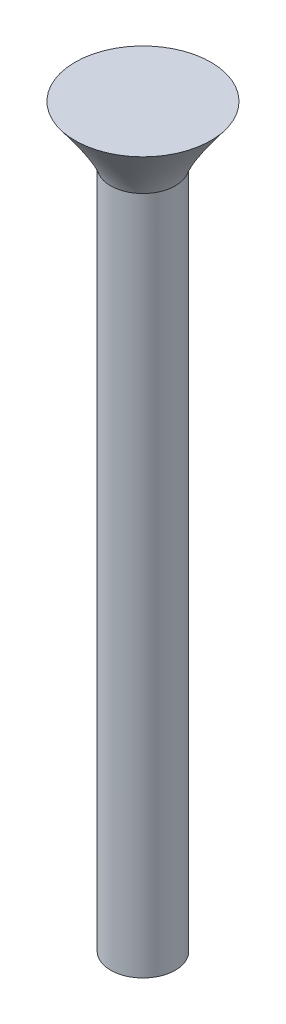
ISO-10303-21;
HEADER;
FILE_DESCRIPTION(('STEP AP214'),'2;1');
FILE_NAME('part.step','',(''),(''),'','','');
FILE_SCHEMA(('AUTOMOTIVE_DESIGN { 1 0 10303 214 1 1 1 1 }'));
ENDSEC;
DATA;
#1=APPLICATION_CONTEXT('core data for automotive mechanical design processes');
#2=APPLICATION_PROTOCOL_DEFINITION('international standard','automotive_design',2000,#1);
#3=PRODUCT_CONTEXT('',#1,'mechanical');
#4=PRODUCT('Part','Part','',(#3));
#5=PRODUCT_RELATED_PRODUCT_CATEGORY('part','',(#4));
#6=PRODUCT_DEFINITION_FORMATION('','',#4);
#7=PRODUCT_DEFINITION_CONTEXT('part definition',#1,'design');
#8=PRODUCT_DEFINITION('design','',#6,#7);
#9=PRODUCT_DEFINITION_SHAPE('','',#8);
#10=(LENGTH_UNIT() NAMED_UNIT(*) SI_UNIT(.MILLI.,.METRE.));
#11=(NAMED_UNIT(*) PLANE_ANGLE_UNIT() SI_UNIT($,.RADIAN.));
#12=(NAMED_UNIT(*) SI_UNIT($,.STERADIAN.) SOLID_ANGLE_UNIT());
#13=UNCERTAINTY_MEASURE_WITH_UNIT(LENGTH_MEASURE(1.E-05),#10,'distance_accuracy_value','');
#14=(GEOMETRIC_REPRESENTATION_CONTEXT(3) GLOBAL_UNCERTAINTY_ASSIGNED_CONTEXT((#13)) GLOBAL_UNIT_ASSIGNED_CONTEXT((#10,
#11,#12)) REPRESENTATION_CONTEXT('',''));
#15=CARTESIAN_POINT('',(0.,0.,0.));
#16=DIRECTION('',(0.,0.,1.));
#17=DIRECTION('',(1.,0.,0.));
#18=AXIS2_PLACEMENT_3D('',#15,#16,#17);
#19=CARTESIAN_POINT('',(0.,20.,0.));
#20=DIRECTION('',(0.,-1.,0.));
#21=DIRECTION('',(0.,0.,-1.));
#22=AXIS2_PLACEMENT_3D('',#19,#20,#21);
#23=CYLINDRICAL_SURFACE('',#22,0.9525);
#24=CARTESIAN_POINT('',(0.,20.,0.));
#25=DIRECTION('',(0.,-1.,0.));
#26=DIRECTION('',(0.,0.,-1.));
#27=AXIS2_PLACEMENT_3D('',#24,#25,#26);
#28=CIRCLE('',#27,0.9525);
#29=CARTESIAN_POINT('',(-0.868111620995261,20.,-0.391967426571366));
#30=VERTEX_POINT('',#29);
#31=EDGE_CURVE('E11',#30,#30,#28,.F.);
#32=ORIENTED_EDGE('',*,*,#31,.F.);
#33=EDGE_LOOP('',(#32));
#34=FACE_BOUND('',#33,.T.);
#35=CARTESIAN_POINT('',(0.,0.,0.));
#36=DIRECTION('',(0.,1.,0.));
#37=DIRECTION('',(0.,0.,1.));
#38=AXIS2_PLACEMENT_3D('',#35,#36,#37);
#39=CIRCLE('',#38,0.9525);
#40=CARTESIAN_POINT('',(0.,0.,0.9525));
#41=VERTEX_POINT('',#40);
#42=EDGE_CURVE('E45',#41,#41,#39,.T.);
#43=ORIENTED_EDGE('',*,*,#42,.T.);
#44=EDGE_LOOP('',(#43));
#45=FACE_BOUND('',#44,.T.);
#46=ADVANCED_FACE('F38',(#34,#45),#23,.T.);
#47=CARTESIAN_POINT('',(0.,0.,0.));
#48=DIRECTION('',(0.,1.,0.));
#49=DIRECTION('',(0.,0.,1.));
#50=AXIS2_PLACEMENT_3D('',#47,#48,#49);
#51=PLANE('',#50);
#52=ORIENTED_EDGE('',*,*,#42,.F.);
#53=EDGE_LOOP('',(#52));
#54=FACE_BOUND('',#53,.T.);
#55=ADVANCED_FACE('F71',(#54),#51,.F.);
#56=CARTESIAN_POINT('',(0.,21.6764,0.));
#57=DIRECTION('',(0.,1.,0.));
#58=DIRECTION('',(0.,0.,1.));
#59=AXIS2_PLACEMENT_3D('',#56,#57,#58);
#60=PLANE('',#59);
#61=CARTESIAN_POINT('',(0.,21.6764,0.));
#62=DIRECTION('',(0.,1.,0.));
#63=DIRECTION('',(0.,0.,1.));
#64=AXIS2_PLACEMENT_3D('',#61,#62,#63);
#65=CIRCLE('',#64,2.);
#66=CARTESIAN_POINT('',(-0.901256532260546,21.6764,-1.78542338481877));
#67=VERTEX_POINT('',#66);
#68=EDGE_CURVE('E49',#67,#67,#65,.T.);
#69=ORIENTED_EDGE('',*,*,#68,.T.);
#70=EDGE_LOOP('',(#69));
#71=FACE_BOUND('',#70,.T.);
#72=ADVANCED_FACE('F61',(#71),#60,.T.);
#73=CARTESIAN_POINT('',(-0.868111620995261,20.,-0.391967426571366));
#74=CARTESIAN_POINT('',(-0.901256532260546,21.6764,-1.78542338481877));
#75=CARTESIAN_POINT('',(-1.65204647413799,20.,1.34425581541916));
#76=CARTESIAN_POINT('',(-4.47210330189808,21.6764,0.0170896797023271));
#77=CARTESIAN_POINT('',(0.0841767678525288,20.,2.12819066856189));
#78=CARTESIAN_POINT('',(-2.66959023737698,21.6764,3.58793644933986));
#79=CARTESIAN_POINT('',(0.868111620995261,20.,0.391967426571366));
#80=CARTESIAN_POINT('',(0.901256532260547,21.6764,1.78542338481876));
#81=CARTESIAN_POINT('',(1.65204647413799,20.,-1.34425581541916));
#82=CARTESIAN_POINT('',(4.47210330189808,21.6764,-0.0170896797023286));
#83=CARTESIAN_POINT('',(-0.0841767678525287,20.,-2.12819066856189));
#84=CARTESIAN_POINT('',(2.66959023737698,21.6764,-3.58793644933986));
#85=CARTESIAN_POINT('',(-0.868111620995261,20.,-0.391967426571366));
#86=CARTESIAN_POINT('',(-0.901256532260546,21.6764,-1.78542338481877));
#87=(BOUNDED_SURFACE() B_SPLINE_SURFACE(3,1,((#73,#74),(#75,#76),(#77,#78),(#79,#80),(#81,#82),
(#83,#84),(#85,#86)),.UNSPECIFIED.,.T.,.F.,.F.) B_SPLINE_SURFACE_WITH_KNOTS((4,3,4),(2,2),(0.,
0.5,1.),(0.,1.),.UNSPECIFIED.) GEOMETRIC_REPRESENTATION_ITEM() RATIONAL_B_SPLINE_SURFACE(((1.,
1.),(0.333333333333333,0.333333333333333),(0.333333333333333,0.333333333333333),(1.,1.),
(0.333333333333333,0.333333333333333),(0.333333333333333,0.333333333333333),(1.,1.))) REPRESENTATION_ITEM('') SURFACE());
#88=CARTESIAN_POINT('',(-0.868111620995261,20.,-0.391967426571366));
#89=CARTESIAN_POINT('',(-0.868456880487608,20.0174625,-0.406482592803109));
#90=CARTESIAN_POINT('',(-0.868802139979955,20.034925,-0.420997759034853));
#91=CARTESIAN_POINT('',(-0.869492658964648,20.06985,-0.450028091498341));
#92=CARTESIAN_POINT('',(-0.869837918456995,20.0873125,-0.464543257730085));
#93=CARTESIAN_POINT('',(-0.870528437441688,20.1222375,-0.493573590193573));
#94=CARTESIAN_POINT('',(-0.870873696934035,20.1397,-0.508088756425317));
#95=CARTESIAN_POINT('',(-0.871564215918728,20.174625,-0.537119088888804));
#96=CARTESIAN_POINT('',(-0.871909475411075,20.1920875,-0.551634255120547));
#97=CARTESIAN_POINT('',(-0.872599994395769,20.2270125,-0.580664587584034));
#98=CARTESIAN_POINT('',(-0.872945253888115,20.244475,-0.595179753815779));
#99=CARTESIAN_POINT('',(-0.873635772872809,20.2794,-0.624210086279267));
#100=CARTESIAN_POINT('',(-0.873981032365156,20.2968625,-0.63872525251101));
#101=CARTESIAN_POINT('',(-0.874671551349849,20.3317875,-0.667755584974497));
#102=CARTESIAN_POINT('',(-0.875016810842196,20.34925,-0.682270751206241));
#103=CARTESIAN_POINT('',(-0.875707329826889,20.384175,-0.711301083669729));
#104=CARTESIAN_POINT('',(-0.876052589319236,20.4016375,-0.725816249901473));
#105=CARTESIAN_POINT('',(-0.876743108303929,20.4365625,-0.75484658236496));
#106=CARTESIAN_POINT('',(-0.877088367796276,20.454025,-0.769361748596703));
#107=CARTESIAN_POINT('',(-0.877778886780969,20.48895,-0.79839208106019));
#108=CARTESIAN_POINT('',(-0.878124146273316,20.5064125,-0.812907247291935));
#109=CARTESIAN_POINT('',(-0.878814665258009,20.5413375,-0.841937579755423));
#110=CARTESIAN_POINT('',(-0.879159924750356,20.5588,-0.856452745987166));
#111=CARTESIAN_POINT('',(-0.87985044373505,20.593725,-0.885483078450653));
#112=CARTESIAN_POINT('',(-0.880195703227396,20.6111875,-0.899998244682397));
#113=CARTESIAN_POINT('',(-0.88088622221209,20.6461125,-0.929028577145884));
#114=CARTESIAN_POINT('',(-0.881231481704437,20.663575,-0.943543743377629));
#115=CARTESIAN_POINT('',(-0.88192200068913,20.6985,-0.972574075841116));
#116=CARTESIAN_POINT('',(-0.882267260181476,20.7159625,-0.98708924207286));
#117=CARTESIAN_POINT('',(-0.88295777916617,20.7508875,-1.01611957453635));
#118=CARTESIAN_POINT('',(-0.883303038658517,20.76835,-1.03063474076809));
#119=CARTESIAN_POINT('',(-0.88399355764321,20.803275,-1.05966507323158));
#120=CARTESIAN_POINT('',(-0.884338817135557,20.8207375,-1.07418023946332));
#121=CARTESIAN_POINT('',(-0.88502933612025,20.8556625,-1.10321057192681));
#122=CARTESIAN_POINT('',(-0.885374595612597,20.873125,-1.11772573815855));
#123=CARTESIAN_POINT('',(-0.88606511459729,20.90805,-1.14675607062204));
#124=CARTESIAN_POINT('',(-0.886410374089637,20.9255125,-1.16127123685378));
#125=CARTESIAN_POINT('',(-0.88710089307433,20.9604375,-1.19030156931727));
#126=CARTESIAN_POINT('',(-0.887446152566677,20.9779,-1.20481673554902));
#127=CARTESIAN_POINT('',(-0.888136671551371,21.012825,-1.2338470680125));
#128=CARTESIAN_POINT('',(-0.888481931043717,21.0302875,-1.24836223424425));
#129=CARTESIAN_POINT('',(-0.889172450028411,21.0652125,-1.27739256670773));
#130=CARTESIAN_POINT('',(-0.889517709520758,21.082675,-1.29190773293948));
#131=CARTESIAN_POINT('',(-0.890208228505451,21.1176,-1.32093806540297));
#132=CARTESIAN_POINT('',(-0.890553487997798,21.1350625,-1.33545323163471));
#133=CARTESIAN_POINT('',(-0.891244006982491,21.1699875,-1.3644835640982));
#134=CARTESIAN_POINT('',(-0.891589266474838,21.18745,-1.37899873032994));
#135=CARTESIAN_POINT('',(-0.892279785459531,21.222375,-1.40802906279343));
#136=CARTESIAN_POINT('',(-0.892625044951878,21.2398375,-1.42254422902517));
#137=CARTESIAN_POINT('',(-0.893315563936571,21.2747625,-1.45157456148866));
#138=CARTESIAN_POINT('',(-0.893660823428918,21.292225,-1.4660897277204));
#139=CARTESIAN_POINT('',(-0.894351342413611,21.32715,-1.49512006018389));
#140=CARTESIAN_POINT('',(-0.894696601905958,21.3446125,-1.50963522641563));
#141=CARTESIAN_POINT('',(-0.895387120890652,21.3795375,-1.53866555887912));
#142=CARTESIAN_POINT('',(-0.895732380382998,21.397,-1.55318072511086));
#143=CARTESIAN_POINT('',(-0.896422899367692,21.431925,-1.58221105757435));
#144=CARTESIAN_POINT('',(-0.896768158860038,21.4493875,-1.5967262238061));
#145=CARTESIAN_POINT('',(-0.897458677844732,21.4843125,-1.62575655626958));
#146=CARTESIAN_POINT('',(-0.897803937337079,21.501775,-1.64027172250133));
#147=CARTESIAN_POINT('',(-0.898494456321772,21.5367,-1.66930205496481));
#148=CARTESIAN_POINT('',(-0.898839715814119,21.5541625,-1.68381722119656));
#149=CARTESIAN_POINT('',(-0.899530234798812,21.5890875,-1.71284755366005));
#150=CARTESIAN_POINT('',(-0.899875494291159,21.60655,-1.72736271989179));
#151=CARTESIAN_POINT('',(-0.900566013275852,21.641475,-1.75639305235528));
#152=CARTESIAN_POINT('',(-0.900911272768199,21.6589375,-1.77090821858702));
#153=CARTESIAN_POINT('',(-0.901256532260546,21.6764,-1.78542338481877));
#154=B_SPLINE_CURVE_WITH_KNOTS('',3,(#88,#89,#90,#91,#92,#93,#94,#95,#96,#97,#98,#99,#100,#101,
#102,#103,#104,#105,#106,#107,#108,#109,#110,#111,#112,#113,#114,#115,#116,#117,#118,#119,#120,
#121,#122,#123,#124,#125,#126,#127,#128,#129,#130,#131,#132,#133,#134,#135,#136,#137,#138,#139,
#140,#141,#142,#143,#144,#145,#146,#147,#148,#149,#150,#151,#152,#153),.UNSPECIFIED.,.F.,.F.,(4,
2,2,2,2,2,2,2,2,2,2,2,2,2,2,2,2,2,2,2,2,2,2,2,2,2,2,2,2,2,2,2,4),(0.,0.0681302682360781,
0.136260536472154,0.204390804708232,0.272521072944312,0.340651341180388,0.408781609416466,
0.476911877652544,0.54504214588862,0.6131724141247,0.681302682360776,0.749432950596854,
0.817563218832932,0.885693487069008,0.953823755305086,1.02195402354116,1.09008429177724,
1.15821456001332,1.2263448282494,1.29447509648548,1.36260536472155,1.43073563295763,
1.49886590119371,1.56699616942978,1.63512643766586,1.70325670590194,1.77138697413802,
1.8395172423741,1.90764751061017,1.97577777884625,2.04390804708233,2.11203831531841,
2.18016858355448),.UNSPECIFIED.);
#155=EDGE_CURVE('BSEAM70',#30,#67,#154,.T.);
#156=ORIENTED_EDGE('',*,*,#31,.T.);
#157=ORIENTED_EDGE('',*,*,#68,.F.);
#158=ORIENTED_EDGE('',*,*,#155,.T.);
#159=ORIENTED_EDGE('',*,*,#155,.F.);
#160=EDGE_LOOP('',(#156,#158,#157,#159));
#161=FACE_BOUND('',#160,.T.);
#162=ADVANCED_FACE('F70',(#161),#87,.T.);
#163=CLOSED_SHELL('',(#46,#55,#72,#162));
#164=MANIFOLD_SOLID_BREP('B2',#163);
#165=ADVANCED_BREP_SHAPE_REPRESENTATION('',(#18,#164),#14);
#166=SHAPE_DEFINITION_REPRESENTATION(#9,#165);
ENDSEC;
END-ISO-10303-21;
